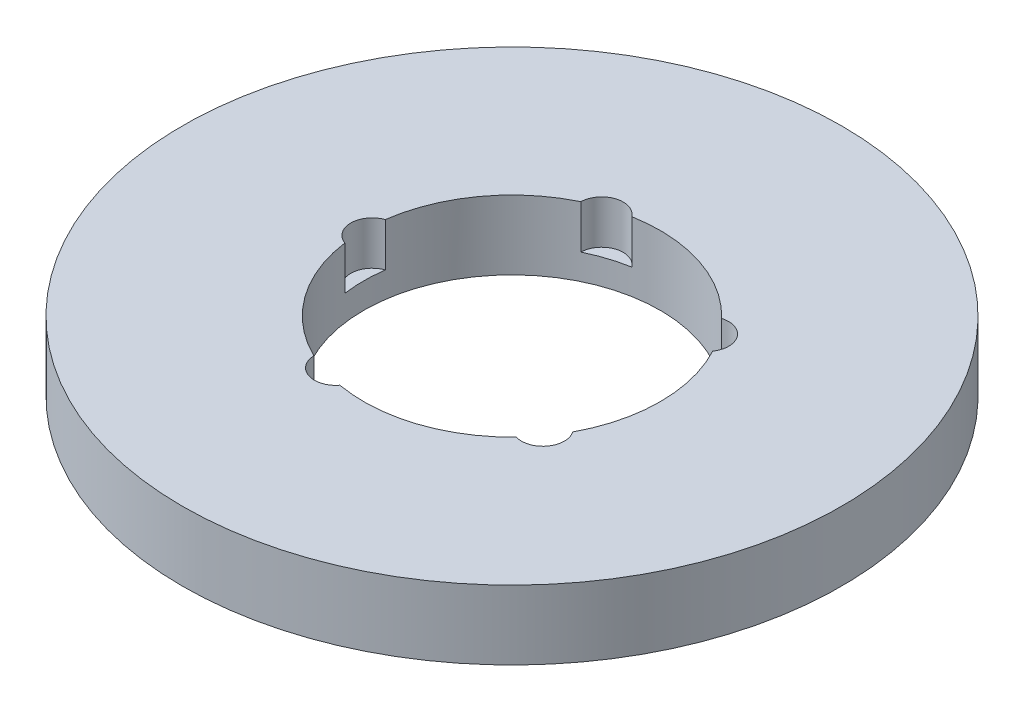
ISO-10303-21;
HEADER;
FILE_DESCRIPTION(('STEP AP214'),'2;1');
FILE_NAME('part.step','',(''),(''),'','','');
FILE_SCHEMA(('AUTOMOTIVE_DESIGN { 1 0 10303 214 1 1 1 1 }'));
ENDSEC;
DATA;
#1=APPLICATION_CONTEXT('core data for automotive mechanical design processes');
#2=APPLICATION_PROTOCOL_DEFINITION('international standard','automotive_design',2000,#1);
#3=PRODUCT_CONTEXT('',#1,'mechanical');
#4=PRODUCT('Part','Part','',(#3));
#5=PRODUCT_RELATED_PRODUCT_CATEGORY('part','',(#4));
#6=PRODUCT_DEFINITION_FORMATION('','',#4);
#7=PRODUCT_DEFINITION_CONTEXT('part definition',#1,'design');
#8=PRODUCT_DEFINITION('design','',#6,#7);
#9=PRODUCT_DEFINITION_SHAPE('','',#8);
#10=(LENGTH_UNIT() NAMED_UNIT(*) SI_UNIT(.MILLI.,.METRE.));
#11=(NAMED_UNIT(*) PLANE_ANGLE_UNIT() SI_UNIT($,.RADIAN.));
#12=(NAMED_UNIT(*) SI_UNIT($,.STERADIAN.) SOLID_ANGLE_UNIT());
#13=UNCERTAINTY_MEASURE_WITH_UNIT(LENGTH_MEASURE(1.E-05),#10,'distance_accuracy_value','');
#14=(GEOMETRIC_REPRESENTATION_CONTEXT(3) GLOBAL_UNCERTAINTY_ASSIGNED_CONTEXT((#13)) GLOBAL_UNIT_ASSIGNED_CONTEXT((#10,
#11,#12)) REPRESENTATION_CONTEXT('',''));
#15=CARTESIAN_POINT('',(0.,0.,0.));
#16=DIRECTION('',(0.,0.,1.));
#17=DIRECTION('',(1.,0.,0.));
#18=AXIS2_PLACEMENT_3D('',#15,#16,#17);
#19=CARTESIAN_POINT('',(0.,21.,0.));
#20=DIRECTION('',(0.,-1.,0.));
#21=DIRECTION('',(0.,0.,-1.));
#22=AXIS2_PLACEMENT_3D('',#19,#20,#21);
#23=CYLINDRICAL_SURFACE('',#22,100.);
#24=CARTESIAN_POINT('',(0.,21.,0.));
#25=DIRECTION('',(0.,1.,0.));
#26=DIRECTION('',(0.,0.,1.));
#27=AXIS2_PLACEMENT_3D('',#24,#25,#26);
#28=CIRCLE('',#27,100.);
#29=CARTESIAN_POINT('',(0.,21.,-100.));
#30=VERTEX_POINT('',#29);
#31=EDGE_CURVE('E159',#30,#30,#28,.T.);
#32=CARTESIAN_POINT('',(0.,0.,0.));
#33=DIRECTION('',(0.,1.,0.));
#34=DIRECTION('',(0.,0.,1.));
#35=AXIS2_PLACEMENT_3D('',#32,#33,#34);
#36=CIRCLE('',#35,100.);
#37=CARTESIAN_POINT('',(0.,0.,-100.));
#38=VERTEX_POINT('',#37);
#39=EDGE_CURVE('E152',#38,#38,#36,.T.);
#40=CARTESIAN_POINT('',(0.,21.,-100.));
#41=CARTESIAN_POINT('',(0.,20.78125,-100.));
#42=CARTESIAN_POINT('',(0.,20.5625,-100.));
#43=CARTESIAN_POINT('',(0.,20.125,-100.));
#44=CARTESIAN_POINT('',(0.,19.90625,-100.));
#45=CARTESIAN_POINT('',(0.,19.46875,-100.));
#46=CARTESIAN_POINT('',(0.,19.25,-100.));
#47=CARTESIAN_POINT('',(0.,18.8125,-100.));
#48=CARTESIAN_POINT('',(0.,18.59375,-100.));
#49=CARTESIAN_POINT('',(0.,18.15625,-100.));
#50=CARTESIAN_POINT('',(0.,17.9375,-100.));
#51=CARTESIAN_POINT('',(0.,17.5,-100.));
#52=CARTESIAN_POINT('',(0.,17.28125,-100.));
#53=CARTESIAN_POINT('',(0.,16.84375,-100.));
#54=CARTESIAN_POINT('',(0.,16.625,-100.));
#55=CARTESIAN_POINT('',(0.,16.1875,-100.));
#56=CARTESIAN_POINT('',(0.,15.96875,-100.));
#57=CARTESIAN_POINT('',(0.,15.53125,-100.));
#58=CARTESIAN_POINT('',(0.,15.3125,-100.));
#59=CARTESIAN_POINT('',(0.,14.875,-100.));
#60=CARTESIAN_POINT('',(0.,14.65625,-100.));
#61=CARTESIAN_POINT('',(0.,14.21875,-100.));
#62=CARTESIAN_POINT('',(0.,14.,-100.));
#63=CARTESIAN_POINT('',(0.,13.5625,-100.));
#64=CARTESIAN_POINT('',(0.,13.34375,-100.));
#65=CARTESIAN_POINT('',(0.,12.90625,-100.));
#66=CARTESIAN_POINT('',(0.,12.6875,-100.));
#67=CARTESIAN_POINT('',(0.,12.25,-100.));
#68=CARTESIAN_POINT('',(0.,12.03125,-100.));
#69=CARTESIAN_POINT('',(0.,11.59375,-100.));
#70=CARTESIAN_POINT('',(0.,11.375,-100.));
#71=CARTESIAN_POINT('',(0.,10.9375,-100.));
#72=CARTESIAN_POINT('',(0.,10.71875,-100.));
#73=CARTESIAN_POINT('',(0.,10.28125,-100.));
#74=CARTESIAN_POINT('',(0.,10.0625,-100.));
#75=CARTESIAN_POINT('',(0.,9.625,-100.));
#76=CARTESIAN_POINT('',(0.,9.40625,-100.));
#77=CARTESIAN_POINT('',(0.,8.96875,-100.));
#78=CARTESIAN_POINT('',(0.,8.75,-100.));
#79=CARTESIAN_POINT('',(0.,8.3125,-100.));
#80=CARTESIAN_POINT('',(0.,8.09375,-100.));
#81=CARTESIAN_POINT('',(0.,7.65625,-100.));
#82=CARTESIAN_POINT('',(0.,7.4375,-100.));
#83=CARTESIAN_POINT('',(0.,7.,-100.));
#84=CARTESIAN_POINT('',(0.,6.78125,-100.));
#85=CARTESIAN_POINT('',(0.,6.34375,-100.));
#86=CARTESIAN_POINT('',(0.,6.125,-100.));
#87=CARTESIAN_POINT('',(0.,5.6875,-100.));
#88=CARTESIAN_POINT('',(0.,5.46875,-100.));
#89=CARTESIAN_POINT('',(0.,5.03125,-100.));
#90=CARTESIAN_POINT('',(0.,4.8125,-100.));
#91=CARTESIAN_POINT('',(0.,4.375,-100.));
#92=CARTESIAN_POINT('',(0.,4.15625,-100.));
#93=CARTESIAN_POINT('',(0.,3.71875,-100.));
#94=CARTESIAN_POINT('',(0.,3.5,-100.));
#95=CARTESIAN_POINT('',(0.,3.0625,-100.));
#96=CARTESIAN_POINT('',(0.,2.84375,-100.));
#97=CARTESIAN_POINT('',(0.,2.40625,-100.));
#98=CARTESIAN_POINT('',(0.,2.1875,-100.));
#99=CARTESIAN_POINT('',(0.,1.75,-100.));
#100=CARTESIAN_POINT('',(0.,1.53125,-100.));
#101=CARTESIAN_POINT('',(0.,1.09375,-100.));
#102=CARTESIAN_POINT('',(0.,0.875000000000001,-100.));
#103=CARTESIAN_POINT('',(0.,0.4375,-100.));
#104=CARTESIAN_POINT('',(0.,0.21875,-100.));
#105=CARTESIAN_POINT('',(0.,0.,-100.));
#106=B_SPLINE_CURVE_WITH_KNOTS('',3,(#40,#41,#42,#43,#44,#45,#46,#47,#48,#49,#50,#51,#52,#53,
#54,#55,#56,#57,#58,#59,#60,#61,#62,#63,#64,#65,#66,#67,#68,#69,#70,#71,#72,#73,#74,#75,#76,#77,
#78,#79,#80,#81,#82,#83,#84,#85,#86,#87,#88,#89,#90,#91,#92,#93,#94,#95,#96,#97,#98,#99,#100,
#101,#102,#103,#104,#105),.UNSPECIFIED.,.F.,.F.,(4,2,2,2,2,2,2,2,2,2,2,2,2,2,2,2,2,2,2,2,2,2,2,
2,2,2,2,2,2,2,2,2,4),(0.,0.656249999999997,1.3125,1.96875,2.625,3.28125,3.9375,4.59375,5.25,
5.90625,6.5625,7.21875,7.875,8.53125,9.1875,9.84375,10.5,11.15625,11.8125,12.46875,13.125,
13.78125,14.4375,15.09375,15.75,16.40625,17.0625,17.71875,18.375,19.03125,19.6875,20.34375,21.),.UNSPECIFIED.);
#107=EDGE_CURVE('BSEAM39',#30,#38,#106,.T.);
#108=ORIENTED_EDGE('',*,*,#31,.F.);
#109=ORIENTED_EDGE('',*,*,#39,.T.);
#110=ORIENTED_EDGE('',*,*,#107,.T.);
#111=ORIENTED_EDGE('',*,*,#107,.F.);
#112=EDGE_LOOP('',(#108,#110,#109,#111));
#113=FACE_BOUND('',#112,.T.);
#114=ADVANCED_FACE('F39',(#113),#23,.T.);
#115=CARTESIAN_POINT('',(0.,21.,0.));
#116=DIRECTION('',(0.,1.,0.));
#117=DIRECTION('',(0.,0.,1.));
#118=AXIS2_PLACEMENT_3D('',#115,#116,#117);
#119=PLANE('',#118);
#120=CARTESIAN_POINT('',(-13.1061054249665,21.,40.3364449029032));
#121=DIRECTION('',(0.,1.,0.));
#122=DIRECTION('',(0.951056516295155,0.,0.309016994374945));
#123=AXIS2_PLACEMENT_3D('',#120,#121,#122);
#124=CIRCLE('',#123,6.51021607121772);
#125=CARTESIAN_POINT('',(-19.6142570838968,21.,40.5003817148284));
#126=VERTEX_POINT('',#125);
#127=CARTESIAN_POINT('',(-7.93725977127985,21.,44.2944681345563));
#128=VERTEX_POINT('',#127);
#129=EDGE_CURVE('E192',#126,#128,#124,.T.);
#130=ORIENTED_EDGE('',*,*,#129,.F.);
#131=CARTESIAN_POINT('',(0.,21.,0.));
#132=DIRECTION('',(0.,1.,0.));
#133=DIRECTION('',(0.,0.,1.));
#134=AXIS2_PLACEMENT_3D('',#131,#132,#133);
#135=CIRCLE('',#134,45.);
#136=CARTESIAN_POINT('',(-44.5792907132919,21.,6.13896078337426));
#137=VERTEX_POINT('',#136);
#138=EDGE_CURVE('E147',#137,#126,#135,.T.);
#139=ORIENTED_EDGE('',*,*,#138,.F.);
#140=CARTESIAN_POINT('',(-42.4122480754708,21.,0.));
#141=DIRECTION('',(0.,1.,0.));
#142=DIRECTION('',(0.,0.,1.));
#143=AXIS2_PLACEMENT_3D('',#140,#141,#142);
#144=CIRCLE('',#143,6.51021607121772);
#145=CARTESIAN_POINT('',(-44.5792907132919,21.,-6.13896078337426));
#146=VERTEX_POINT('',#145);
#147=EDGE_CURVE('E154',#146,#137,#144,.T.);
#148=ORIENTED_EDGE('',*,*,#147,.F.);
#149=CARTESIAN_POINT('',(-19.6142570838974,21.,-40.5003817148281));
#150=VERTEX_POINT('',#149);
#151=EDGE_CURVE('E136',#150,#146,#135,.T.);
#152=ORIENTED_EDGE('',*,*,#151,.F.);
#153=CARTESIAN_POINT('',(-13.1061054249671,21.,-40.336444902903));
#154=DIRECTION('',(0.,1.,0.));
#155=DIRECTION('',(-0.95105651629515,0.,0.309016994374958));
#156=AXIS2_PLACEMENT_3D('',#153,#154,#155);
#157=CIRCLE('',#156,6.51021607121772);
#158=CARTESIAN_POINT('',(-7.93725977128048,21.,-44.2944681345562));
#159=VERTEX_POINT('',#158);
#160=EDGE_CURVE('E117',#159,#150,#157,.T.);
#161=ORIENTED_EDGE('',*,*,#160,.F.);
#162=CARTESIAN_POINT('',(32.4570131713649,21.,-31.1695732404832));
#163=VERTEX_POINT('',#162);
#164=EDGE_CURVE('E133',#163,#159,#135,.T.);
#165=ORIENTED_EDGE('',*,*,#164,.F.);
#166=CARTESIAN_POINT('',(34.3122294627019,21.,-24.9292939353319));
#167=DIRECTION('',(0.,1.,0.));
#168=DIRECTION('',(-0.58778525229248,0.,-0.809016994374942));
#169=AXIS2_PLACEMENT_3D('',#166,#167,#168);
#170=CIRCLE('',#169,6.51021607121772);
#171=CARTESIAN_POINT('',(39.6737943971035,21.,-21.236526037381));
#172=VERTEX_POINT('',#171);
#173=EDGE_CURVE('E333',#172,#163,#170,.T.);
#174=ORIENTED_EDGE('',*,*,#173,.F.);
#175=CARTESIAN_POINT('',(39.6737943971038,21.,21.2365260373804));
#176=VERTEX_POINT('',#175);
#177=EDGE_CURVE('E144',#176,#172,#135,.T.);
#178=ORIENTED_EDGE('',*,*,#177,.F.);
#179=CARTESIAN_POINT('',(34.3122294627022,21.,24.9292939353314));
#180=DIRECTION('',(0.,1.,0.));
#181=DIRECTION('',(0.587785252292469,0.,-0.809016994374951));
#182=AXIS2_PLACEMENT_3D('',#179,#180,#181);
#183=CIRCLE('',#182,6.51021607121772);
#184=CARTESIAN_POINT('',(32.4570131713654,21.,31.1695732404827));
#185=VERTEX_POINT('',#184);
#186=EDGE_CURVE('E328',#185,#176,#183,.T.);
#187=ORIENTED_EDGE('',*,*,#186,.F.);
#188=EDGE_CURVE('E146',#128,#185,#135,.T.);
#189=ORIENTED_EDGE('',*,*,#188,.F.);
#190=EDGE_LOOP('',(#130,#139,#148,#152,#161,#165,#174,#178,#187,#189));
#191=FACE_BOUND('',#190,.T.);
#192=ORIENTED_EDGE('',*,*,#31,.T.);
#193=EDGE_LOOP('',(#192));
#194=FACE_BOUND('',#193,.T.);
#195=ADVANCED_FACE('F131',(#191,#194),#119,.T.);
#196=CARTESIAN_POINT('',(0.,0.,0.));
#197=DIRECTION('',(0.,1.,0.));
#198=DIRECTION('',(0.,0.,1.));
#199=AXIS2_PLACEMENT_3D('',#196,#197,#198);
#200=PLANE('',#199);
#201=CARTESIAN_POINT('',(0.,0.,0.));
#202=DIRECTION('',(0.,1.,0.));
#203=DIRECTION('',(0.,0.,1.));
#204=AXIS2_PLACEMENT_3D('',#201,#202,#203);
#205=CIRCLE('',#204,45.);
#206=CARTESIAN_POINT('',(0.,0.,45.));
#207=VERTEX_POINT('',#206);
#208=EDGE_CURVE('E149',#207,#207,#205,.T.);
#209=ORIENTED_EDGE('',*,*,#208,.T.);
#210=EDGE_LOOP('',(#209));
#211=FACE_BOUND('',#210,.T.);
#212=ORIENTED_EDGE('',*,*,#39,.F.);
#213=EDGE_LOOP('',(#212));
#214=FACE_BOUND('',#213,.T.);
#215=ADVANCED_FACE('F209',(#211,#214),#200,.F.);
#216=CARTESIAN_POINT('',(0.,21.,0.));
#217=DIRECTION('',(0.,-1.,0.));
#218=DIRECTION('',(0.,0.,-1.));
#219=AXIS2_PLACEMENT_3D('',#216,#217,#218);
#220=CYLINDRICAL_SURFACE('',#219,45.);
#221=DIRECTION('',(0.,1.,0.));
#222=VECTOR('',#221,1.);
#223=CARTESIAN_POINT('',(-19.6142570838968,14.3792285276979,40.5003817148283));
#224=LINE('',#223,#222);
#225=CARTESIAN_POINT('',(-19.6142570838968,7.75845705539578,40.5003817148284));
#226=VERTEX_POINT('',#225);
#227=EDGE_CURVE('E11',#226,#126,#224,.T.);
#228=ORIENTED_EDGE('',*,*,#227,.F.);
#229=CARTESIAN_POINT('',(0.,7.75845705539578,0.));
#230=DIRECTION('',(0.,1.,0.));
#231=DIRECTION('',(0.,0.,1.));
#232=AXIS2_PLACEMENT_3D('',#229,#230,#231);
#233=CIRCLE('',#232,45.);
#234=CARTESIAN_POINT('',(-7.93725977127985,7.75845705539578,44.2944681345563));
#235=VERTEX_POINT('',#234);
#236=EDGE_CURVE('E187',#226,#235,#233,.T.);
#237=ORIENTED_EDGE('',*,*,#236,.T.);
#238=DIRECTION('',(0.,1.,0.));
#239=VECTOR('',#238,1.);
#240=CARTESIAN_POINT('',(-7.93725977127985,14.3792285276979,44.2944681345563));
#241=LINE('',#240,#239);
#242=EDGE_CURVE('E46',#128,#235,#241,.F.);
#243=ORIENTED_EDGE('',*,*,#242,.F.);
#244=ORIENTED_EDGE('',*,*,#188,.T.);
#245=DIRECTION('',(0.,1.,0.));
#246=VECTOR('',#245,1.);
#247=CARTESIAN_POINT('',(32.4570131713654,14.3792285276979,31.1695732404827));
#248=LINE('',#247,#246);
#249=CARTESIAN_POINT('',(32.4570131713654,7.75845705539578,31.1695732404827));
#250=VERTEX_POINT('',#249);
#251=EDGE_CURVE('E186',#250,#185,#248,.T.);
#252=ORIENTED_EDGE('',*,*,#251,.F.);
#253=CARTESIAN_POINT('',(0.,7.75845705539578,0.));
#254=DIRECTION('',(0.,1.,0.));
#255=DIRECTION('',(0.,0.,1.));
#256=AXIS2_PLACEMENT_3D('',#253,#254,#255);
#257=CIRCLE('',#256,45.);
#258=CARTESIAN_POINT('',(39.6737943971038,7.75845705539578,21.2365260373804));
#259=VERTEX_POINT('',#258);
#260=EDGE_CURVE('E182',#250,#259,#257,.T.);
#261=ORIENTED_EDGE('',*,*,#260,.T.);
#262=DIRECTION('',(0.,1.,0.));
#263=VECTOR('',#262,1.);
#264=CARTESIAN_POINT('',(39.6737943971038,14.3792285276979,21.2365260373804));
#265=LINE('',#264,#263);
#266=EDGE_CURVE('E184',#176,#259,#265,.F.);
#267=ORIENTED_EDGE('',*,*,#266,.F.);
#268=ORIENTED_EDGE('',*,*,#177,.T.);
#269=DIRECTION('',(0.,1.,0.));
#270=VECTOR('',#269,1.);
#271=CARTESIAN_POINT('',(39.6737943971035,14.3792285276979,-21.236526037381));
#272=LINE('',#271,#270);
#273=CARTESIAN_POINT('',(39.6737943971035,7.75845705539578,-21.236526037381));
#274=VERTEX_POINT('',#273);
#275=EDGE_CURVE('E178',#274,#172,#272,.T.);
#276=ORIENTED_EDGE('',*,*,#275,.F.);
#277=CARTESIAN_POINT('',(0.,7.75845705539578,0.));
#278=DIRECTION('',(0.,1.,0.));
#279=DIRECTION('',(0.,0.,1.));
#280=AXIS2_PLACEMENT_3D('',#277,#278,#279);
#281=CIRCLE('',#280,45.);
#282=CARTESIAN_POINT('',(32.4570131713649,7.75845705539578,-31.1695732404832));
#283=VERTEX_POINT('',#282);
#284=EDGE_CURVE('E123',#274,#283,#281,.T.);
#285=ORIENTED_EDGE('',*,*,#284,.T.);
#286=DIRECTION('',(0.,1.,0.));
#287=VECTOR('',#286,1.);
#288=CARTESIAN_POINT('',(32.4570131713649,14.3792285276979,-31.1695732404832));
#289=LINE('',#288,#287);
#290=EDGE_CURVE('E145',#163,#283,#289,.F.);
#291=ORIENTED_EDGE('',*,*,#290,.F.);
#292=ORIENTED_EDGE('',*,*,#164,.T.);
#293=DIRECTION('',(0.,1.,0.));
#294=VECTOR('',#293,1.);
#295=CARTESIAN_POINT('',(-7.93725977128048,14.3792285276979,-44.2944681345562));
#296=LINE('',#295,#294);
#297=CARTESIAN_POINT('',(-7.93725977128048,7.75845705539578,-44.2944681345562));
#298=VERTEX_POINT('',#297);
#299=EDGE_CURVE('E111',#298,#159,#296,.T.);
#300=ORIENTED_EDGE('',*,*,#299,.F.);
#301=CARTESIAN_POINT('',(0.,7.75845705539578,0.));
#302=DIRECTION('',(0.,1.,0.));
#303=DIRECTION('',(0.,0.,1.));
#304=AXIS2_PLACEMENT_3D('',#301,#302,#303);
#305=CIRCLE('',#304,45.);
#306=CARTESIAN_POINT('',(-19.6142570838974,7.75845705539578,-40.5003817148281));
#307=VERTEX_POINT('',#306);
#308=EDGE_CURVE('E173',#298,#307,#305,.T.);
#309=ORIENTED_EDGE('',*,*,#308,.T.);
#310=DIRECTION('',(0.,1.,0.));
#311=VECTOR('',#310,1.);
#312=CARTESIAN_POINT('',(-19.6142570838974,14.3792285276979,-40.5003817148281));
#313=LINE('',#312,#311);
#314=EDGE_CURVE('E124',#150,#307,#313,.F.);
#315=ORIENTED_EDGE('',*,*,#314,.F.);
#316=ORIENTED_EDGE('',*,*,#151,.T.);
#317=DIRECTION('',(0.,1.,0.));
#318=VECTOR('',#317,1.);
#319=CARTESIAN_POINT('',(-44.5792907132919,14.3792285276979,-6.13896078337426));
#320=LINE('',#319,#318);
#321=CARTESIAN_POINT('',(-44.5792907132919,7.75845705539578,-6.13896078337426));
#322=VERTEX_POINT('',#321);
#323=EDGE_CURVE('E171',#322,#146,#320,.T.);
#324=ORIENTED_EDGE('',*,*,#323,.F.);
#325=CARTESIAN_POINT('',(0.,7.75845705539578,0.));
#326=DIRECTION('',(0.,1.,0.));
#327=DIRECTION('',(0.,0.,1.));
#328=AXIS2_PLACEMENT_3D('',#325,#326,#327);
#329=CIRCLE('',#328,45.);
#330=CARTESIAN_POINT('',(-44.5792907132919,7.75845705539578,6.13896078337426));
#331=VERTEX_POINT('',#330);
#332=EDGE_CURVE('E162',#322,#331,#329,.T.);
#333=ORIENTED_EDGE('',*,*,#332,.T.);
#334=DIRECTION('',(0.,1.,0.));
#335=VECTOR('',#334,1.);
#336=CARTESIAN_POINT('',(-44.5792907132919,14.3792285276979,6.13896078337426));
#337=LINE('',#336,#335);
#338=EDGE_CURVE('E169',#137,#331,#337,.F.);
#339=ORIENTED_EDGE('',*,*,#338,.F.);
#340=ORIENTED_EDGE('',*,*,#138,.T.);
#341=EDGE_LOOP('',(#228,#237,#243,#244,#252,#261,#267,#268,#276,#285,#291,#292,#300,#309,#315,
#316,#324,#333,#339,#340));
#342=FACE_BOUND('',#341,.T.);
#343=ORIENTED_EDGE('',*,*,#208,.F.);
#344=EDGE_LOOP('',(#343));
#345=FACE_BOUND('',#344,.T.);
#346=ADVANCED_FACE('F139',(#342,#345),#220,.F.);
#347=CARTESIAN_POINT('',(-42.4122480754708,7.75845705539578,0.));
#348=DIRECTION('',(0.,1.,0.));
#349=DIRECTION('',(0.,0.,1.));
#350=AXIS2_PLACEMENT_3D('',#347,#348,#349);
#351=CYLINDRICAL_SURFACE('',#350,6.51021607121772);
#352=ORIENTED_EDGE('',*,*,#323,.T.);
#353=ORIENTED_EDGE('',*,*,#147,.T.);
#354=ORIENTED_EDGE('',*,*,#338,.T.);
#355=CARTESIAN_POINT('',(-42.4122480754708,7.75845705539578,0.));
#356=DIRECTION('',(0.,1.,0.));
#357=DIRECTION('',(0.,0.,1.));
#358=AXIS2_PLACEMENT_3D('',#355,#356,#357);
#359=CIRCLE('',#358,6.51021607121772);
#360=EDGE_CURVE('E157',#322,#331,#359,.T.);
#361=ORIENTED_EDGE('',*,*,#360,.F.);
#362=EDGE_LOOP('',(#352,#353,#354,#361));
#363=FACE_BOUND('',#362,.T.);
#364=ADVANCED_FACE('F222',(#363),#351,.F.);
#365=CARTESIAN_POINT('',(-42.4122480754708,7.75845705539578,0.));
#366=DIRECTION('',(0.,1.,0.));
#367=DIRECTION('',(0.,0.,1.));
#368=AXIS2_PLACEMENT_3D('',#365,#366,#367);
#369=PLANE('',#368);
#370=ORIENTED_EDGE('',*,*,#360,.T.);
#371=ORIENTED_EDGE('',*,*,#332,.F.);
#372=EDGE_LOOP('',(#370,#371));
#373=FACE_BOUND('',#372,.T.);
#374=ADVANCED_FACE('F223',(#373),#369,.T.);
#375=CARTESIAN_POINT('',(-13.1061054249671,7.75845705539578,-40.336444902903));
#376=DIRECTION('',(0.,1.,0.));
#377=DIRECTION('',(0.,0.,1.));
#378=AXIS2_PLACEMENT_3D('',#375,#376,#377);
#379=CYLINDRICAL_SURFACE('',#378,6.51021607121772);
#380=ORIENTED_EDGE('',*,*,#299,.T.);
#381=ORIENTED_EDGE('',*,*,#160,.T.);
#382=ORIENTED_EDGE('',*,*,#314,.T.);
#383=CARTESIAN_POINT('',(-13.1061054249671,7.75845705539578,-40.336444902903));
#384=DIRECTION('',(0.,1.,0.));
#385=DIRECTION('',(-0.95105651629515,0.,0.309016994374958));
#386=AXIS2_PLACEMENT_3D('',#383,#384,#385);
#387=CIRCLE('',#386,6.51021607121772);
#388=EDGE_CURVE('E119',#298,#307,#387,.T.);
#389=ORIENTED_EDGE('',*,*,#388,.F.);
#390=EDGE_LOOP('',(#380,#381,#382,#389));
#391=FACE_BOUND('',#390,.T.);
#392=ADVANCED_FACE('F116',(#391),#379,.F.);
#393=CARTESIAN_POINT('',(-13.1061054249671,7.75845705539578,-40.336444902903));
#394=DIRECTION('',(0.,1.,0.));
#395=DIRECTION('',(-0.95105651629515,0.,0.309016994374958));
#396=AXIS2_PLACEMENT_3D('',#393,#394,#395);
#397=PLANE('',#396);
#398=ORIENTED_EDGE('',*,*,#388,.T.);
#399=ORIENTED_EDGE('',*,*,#308,.F.);
#400=EDGE_LOOP('',(#398,#399));
#401=FACE_BOUND('',#400,.T.);
#402=ADVANCED_FACE('F235',(#401),#397,.T.);
#403=CARTESIAN_POINT('',(34.3122294627019,7.75845705539578,-24.9292939353319));
#404=DIRECTION('',(0.,1.,0.));
#405=DIRECTION('',(0.,0.,1.));
#406=AXIS2_PLACEMENT_3D('',#403,#404,#405);
#407=CYLINDRICAL_SURFACE('',#406,6.51021607121772);
#408=ORIENTED_EDGE('',*,*,#275,.T.);
#409=ORIENTED_EDGE('',*,*,#173,.T.);
#410=ORIENTED_EDGE('',*,*,#290,.T.);
#411=CARTESIAN_POINT('',(34.3122294627019,7.75845705539578,-24.9292939353319));
#412=DIRECTION('',(0.,1.,0.));
#413=DIRECTION('',(-0.58778525229248,0.,-0.809016994374942));
#414=AXIS2_PLACEMENT_3D('',#411,#412,#413);
#415=CIRCLE('',#414,6.51021607121772);
#416=EDGE_CURVE('E335',#274,#283,#415,.T.);
#417=ORIENTED_EDGE('',*,*,#416,.F.);
#418=EDGE_LOOP('',(#408,#409,#410,#417));
#419=FACE_BOUND('',#418,.T.);
#420=ADVANCED_FACE('F234',(#419),#407,.F.);
#421=CARTESIAN_POINT('',(34.3122294627019,7.75845705539578,-24.9292939353319));
#422=DIRECTION('',(0.,1.,0.));
#423=DIRECTION('',(-0.58778525229248,0.,-0.809016994374942));
#424=AXIS2_PLACEMENT_3D('',#421,#422,#423);
#425=PLANE('',#424);
#426=ORIENTED_EDGE('',*,*,#416,.T.);
#427=ORIENTED_EDGE('',*,*,#284,.F.);
#428=EDGE_LOOP('',(#426,#427));
#429=FACE_BOUND('',#428,.T.);
#430=ADVANCED_FACE('F239',(#429),#425,.T.);
#431=CARTESIAN_POINT('',(34.3122294627022,7.75845705539578,24.9292939353314));
#432=DIRECTION('',(0.,1.,0.));
#433=DIRECTION('',(0.,0.,1.));
#434=AXIS2_PLACEMENT_3D('',#431,#432,#433);
#435=CYLINDRICAL_SURFACE('',#434,6.51021607121772);
#436=ORIENTED_EDGE('',*,*,#251,.T.);
#437=ORIENTED_EDGE('',*,*,#186,.T.);
#438=ORIENTED_EDGE('',*,*,#266,.T.);
#439=CARTESIAN_POINT('',(34.3122294627022,7.75845705539578,24.9292939353314));
#440=DIRECTION('',(0.,1.,0.));
#441=DIRECTION('',(0.587785252292469,0.,-0.809016994374951));
#442=AXIS2_PLACEMENT_3D('',#439,#440,#441);
#443=CIRCLE('',#442,6.51021607121772);
#444=EDGE_CURVE('E56',#250,#259,#443,.T.);
#445=ORIENTED_EDGE('',*,*,#444,.F.);
#446=EDGE_LOOP('',(#436,#437,#438,#445));
#447=FACE_BOUND('',#446,.T.);
#448=ADVANCED_FACE('F242',(#447),#435,.F.);
#449=CARTESIAN_POINT('',(34.3122294627022,7.75845705539578,24.9292939353314));
#450=DIRECTION('',(0.,1.,0.));
#451=DIRECTION('',(0.587785252292469,0.,-0.809016994374951));
#452=AXIS2_PLACEMENT_3D('',#449,#450,#451);
#453=PLANE('',#452);
#454=ORIENTED_EDGE('',*,*,#444,.T.);
#455=ORIENTED_EDGE('',*,*,#260,.F.);
#456=EDGE_LOOP('',(#454,#455));
#457=FACE_BOUND('',#456,.T.);
#458=ADVANCED_FACE('F205',(#457),#453,.T.);
#459=CARTESIAN_POINT('',(-13.1061054249665,7.75845705539578,40.3364449029032));
#460=DIRECTION('',(0.,1.,0.));
#461=DIRECTION('',(0.,0.,1.));
#462=AXIS2_PLACEMENT_3D('',#459,#460,#461);
#463=CYLINDRICAL_SURFACE('',#462,6.51021607121772);
#464=ORIENTED_EDGE('',*,*,#227,.T.);
#465=ORIENTED_EDGE('',*,*,#129,.T.);
#466=ORIENTED_EDGE('',*,*,#242,.T.);
#467=CARTESIAN_POINT('',(-13.1061054249665,7.75845705539578,40.3364449029032));
#468=DIRECTION('',(0.,1.,0.));
#469=DIRECTION('',(0.951056516295155,0.,0.309016994374945));
#470=AXIS2_PLACEMENT_3D('',#467,#468,#469);
#471=CIRCLE('',#470,6.51021607121772);
#472=EDGE_CURVE('E55',#226,#235,#471,.T.);
#473=ORIENTED_EDGE('',*,*,#472,.F.);
#474=EDGE_LOOP('',(#464,#465,#466,#473));
#475=FACE_BOUND('',#474,.T.);
#476=ADVANCED_FACE('F195',(#475),#463,.F.);
#477=CARTESIAN_POINT('',(-13.1061054249665,7.75845705539578,40.3364449029032));
#478=DIRECTION('',(0.,1.,0.));
#479=DIRECTION('',(0.951056516295155,0.,0.309016994374945));
#480=AXIS2_PLACEMENT_3D('',#477,#478,#479);
#481=PLANE('',#480);
#482=ORIENTED_EDGE('',*,*,#472,.T.);
#483=ORIENTED_EDGE('',*,*,#236,.F.);
#484=EDGE_LOOP('',(#482,#483));
#485=FACE_BOUND('',#484,.T.);
#486=ADVANCED_FACE('F198',(#485),#481,.T.);
#487=CLOSED_SHELL('',(#114,#195,#215,#346,#364,#374,#392,#402,#420,#430,#448,#458,#476,#486));
#488=MANIFOLD_SOLID_BREP('B2',#487);
#489=ADVANCED_BREP_SHAPE_REPRESENTATION('',(#18,#488),#14);
#490=SHAPE_DEFINITION_REPRESENTATION(#9,#489);
ENDSEC;
END-ISO-10303-21;
